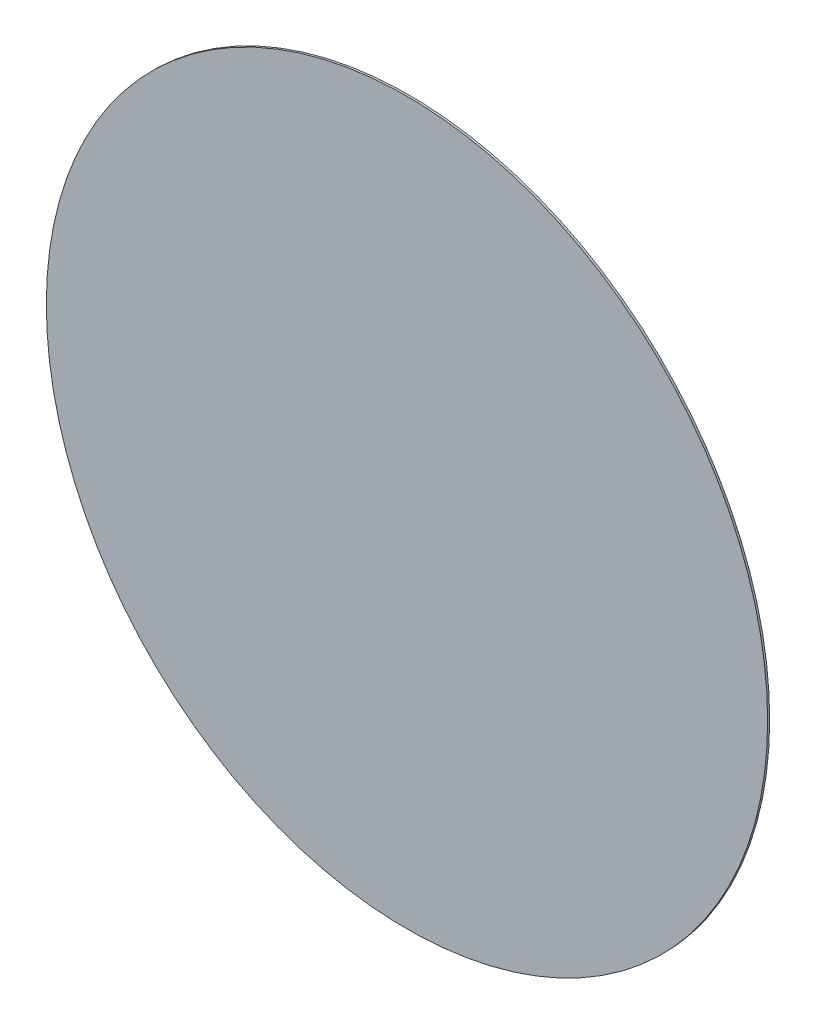
ISO-10303-21;
HEADER;
FILE_DESCRIPTION(('STEP AP214'),'2;1');
FILE_NAME('part.step','',(''),(''),'','','');
FILE_SCHEMA(('AUTOMOTIVE_DESIGN { 1 0 10303 214 1 1 1 1 }'));
ENDSEC;
DATA;
#1=APPLICATION_CONTEXT('core data for automotive mechanical design processes');
#2=APPLICATION_PROTOCOL_DEFINITION('international standard','automotive_design',2000,#1);
#3=PRODUCT_CONTEXT('',#1,'mechanical');
#4=PRODUCT('Part','Part','',(#3));
#5=PRODUCT_RELATED_PRODUCT_CATEGORY('part','',(#4));
#6=PRODUCT_DEFINITION_FORMATION('','',#4);
#7=PRODUCT_DEFINITION_CONTEXT('part definition',#1,'design');
#8=PRODUCT_DEFINITION('design','',#6,#7);
#9=PRODUCT_DEFINITION_SHAPE('','',#8);
#10=(LENGTH_UNIT() NAMED_UNIT(*) SI_UNIT(.MILLI.,.METRE.));
#11=(NAMED_UNIT(*) PLANE_ANGLE_UNIT() SI_UNIT($,.RADIAN.));
#12=(NAMED_UNIT(*) SI_UNIT($,.STERADIAN.) SOLID_ANGLE_UNIT());
#13=UNCERTAINTY_MEASURE_WITH_UNIT(LENGTH_MEASURE(1.E-05),#10,'distance_accuracy_value','');
#14=(GEOMETRIC_REPRESENTATION_CONTEXT(3) GLOBAL_UNCERTAINTY_ASSIGNED_CONTEXT((#13)) GLOBAL_UNIT_ASSIGNED_CONTEXT((#10,
#11,#12)) REPRESENTATION_CONTEXT('',''));
#15=CARTESIAN_POINT('',(0.,0.,0.));
#16=DIRECTION('',(0.,0.,1.));
#17=DIRECTION('',(1.,0.,0.));
#18=AXIS2_PLACEMENT_3D('',#15,#16,#17);
#19=CARTESIAN_POINT('',(0.,0.,0.00100076));
#20=DIRECTION('',(0.,0.,1.));
#21=DIRECTION('',(1.,0.,0.));
#22=AXIS2_PLACEMENT_3D('',#19,#20,#21);
#23=PLANE('',#22);
#24=CARTESIAN_POINT('',(0.,0.,0.00100076));
#25=DIRECTION('',(0.,0.,1.));
#26=DIRECTION('',(1.,0.,0.));
#27=AXIS2_PLACEMENT_3D('',#24,#25,#26);
#28=CIRCLE('',#27,0.17500092);
#29=CARTESIAN_POINT('',(0.17500092,0.,0.00100076));
#30=VERTEX_POINT('',#29);
#31=EDGE_CURVE('E11',#30,#30,#28,.T.);
#32=ORIENTED_EDGE('',*,*,#31,.T.);
#33=EDGE_LOOP('',(#32));
#34=FACE_BOUND('',#33,.T.);
#35=ADVANCED_FACE('F17',(#34),#23,.T.);
#36=CARTESIAN_POINT('',(0.,0.,0.));
#37=DIRECTION('',(0.,0.,1.));
#38=DIRECTION('',(1.,0.,0.));
#39=AXIS2_PLACEMENT_3D('',#36,#37,#38);
#40=PLANE('',#39);
#41=CARTESIAN_POINT('',(0.,0.,0.));
#42=DIRECTION('',(0.,0.,1.));
#43=DIRECTION('',(1.,0.,0.));
#44=AXIS2_PLACEMENT_3D('',#41,#42,#43);
#45=CIRCLE('',#44,0.17500092);
#46=CARTESIAN_POINT('',(0.17500092,0.,0.));
#47=VERTEX_POINT('',#46);
#48=EDGE_CURVE('E43',#47,#47,#45,.T.);
#49=ORIENTED_EDGE('',*,*,#48,.F.);
#50=EDGE_LOOP('',(#49));
#51=FACE_BOUND('',#50,.T.);
#52=ADVANCED_FACE('F19',(#51),#40,.F.);
#53=CARTESIAN_POINT('',(0.,0.,0.));
#54=DIRECTION('',(0.,0.,-1.));
#55=DIRECTION('',(1.,0.,0.));
#56=AXIS2_PLACEMENT_3D('',#53,#54,#55);
#57=CYLINDRICAL_SURFACE('',#56,0.17500092);
#58=ORIENTED_EDGE('',*,*,#48,.T.);
#59=DIRECTION('',(0.,0.,1.));
#60=VECTOR('',#59,1.);
#61=CARTESIAN_POINT('',(0.17500092,0.,0.));
#62=LINE('',#61,#60);
#63=EDGE_CURVE('E26',#47,#30,#62,.T.);
#64=ORIENTED_EDGE('',*,*,#63,.T.);
#65=ORIENTED_EDGE('',*,*,#31,.F.);
#66=ORIENTED_EDGE('',*,*,#63,.F.);
#67=EDGE_LOOP('',(#58,#64,#65,#66));
#68=FACE_BOUND('',#67,.T.);
#69=ADVANCED_FACE('F41',(#68),#57,.T.);
#70=CLOSED_SHELL('',(#35,#52,#69));
#71=MANIFOLD_SOLID_BREP('B1',#70);
#72=ADVANCED_BREP_SHAPE_REPRESENTATION('',(#18,#71),#14);
#73=SHAPE_DEFINITION_REPRESENTATION(#9,#72);
ENDSEC;
END-ISO-10303-21;
